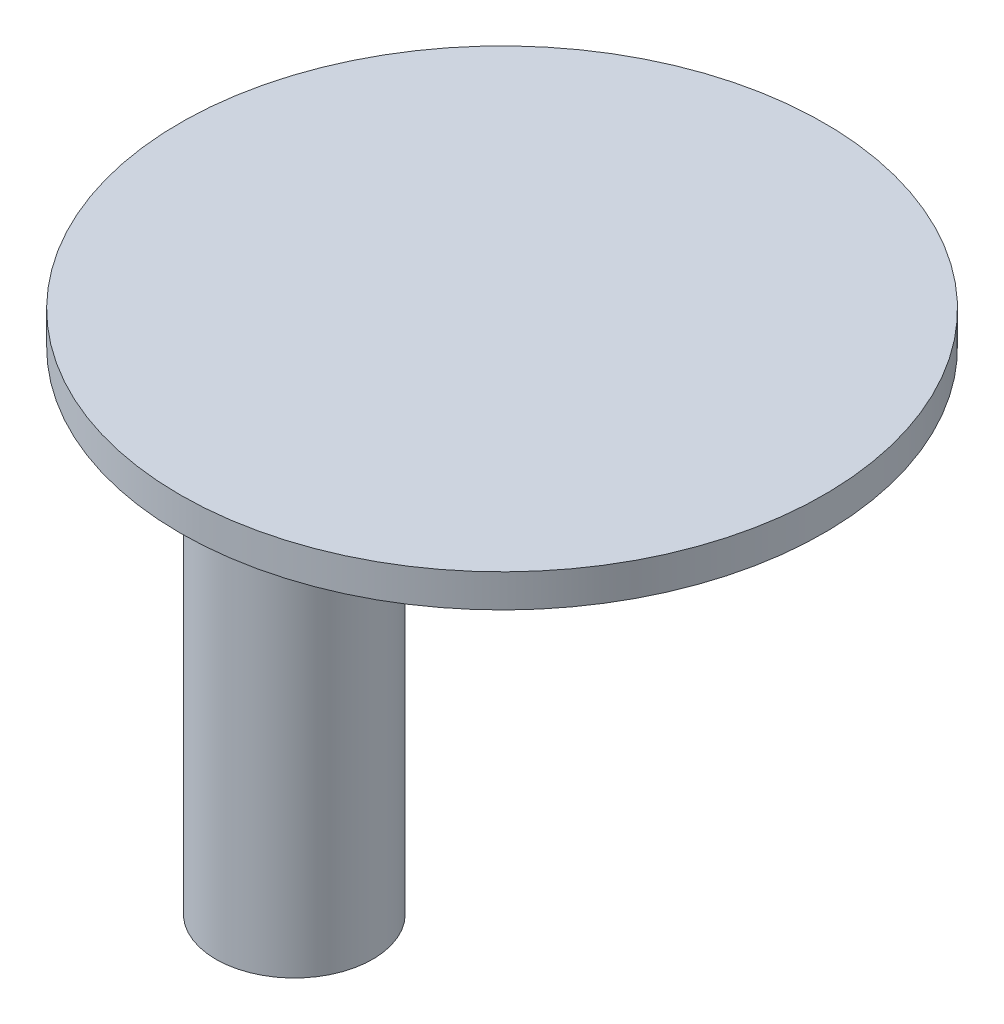
ISO-10303-21;
HEADER;
FILE_DESCRIPTION(('STEP AP214'),'2;1');
FILE_NAME('part.step','',(''),(''),'','','');
FILE_SCHEMA(('AUTOMOTIVE_DESIGN { 1 0 10303 214 1 1 1 1 }'));
ENDSEC;
DATA;
#1=APPLICATION_CONTEXT('core data for automotive mechanical design processes');
#2=APPLICATION_PROTOCOL_DEFINITION('international standard','automotive_design',2000,#1);
#3=PRODUCT_CONTEXT('',#1,'mechanical');
#4=PRODUCT('Part','Part','',(#3));
#5=PRODUCT_RELATED_PRODUCT_CATEGORY('part','',(#4));
#6=PRODUCT_DEFINITION_FORMATION('','',#4);
#7=PRODUCT_DEFINITION_CONTEXT('part definition',#1,'design');
#8=PRODUCT_DEFINITION('design','',#6,#7);
#9=PRODUCT_DEFINITION_SHAPE('','',#8);
#10=(LENGTH_UNIT() NAMED_UNIT(*) SI_UNIT(.MILLI.,.METRE.));
#11=(NAMED_UNIT(*) PLANE_ANGLE_UNIT() SI_UNIT($,.RADIAN.));
#12=(NAMED_UNIT(*) SI_UNIT($,.STERADIAN.) SOLID_ANGLE_UNIT());
#13=UNCERTAINTY_MEASURE_WITH_UNIT(LENGTH_MEASURE(1.E-05),#10,'distance_accuracy_value','');
#14=(GEOMETRIC_REPRESENTATION_CONTEXT(3) GLOBAL_UNCERTAINTY_ASSIGNED_CONTEXT((#13)) GLOBAL_UNIT_ASSIGNED_CONTEXT((#10,
#11,#12)) REPRESENTATION_CONTEXT('',''));
#15=CARTESIAN_POINT('',(0.,0.,0.));
#16=DIRECTION('',(0.,0.,1.));
#17=DIRECTION('',(1.,0.,0.));
#18=AXIS2_PLACEMENT_3D('',#15,#16,#17);
#19=CARTESIAN_POINT('',(0.,32.,0.));
#20=DIRECTION('',(0.,-1.,0.));
#21=DIRECTION('',(0.,0.,-1.));
#22=AXIS2_PLACEMENT_3D('',#19,#20,#21);
#23=CYLINDRICAL_SURFACE('',#22,4.75);
#24=CARTESIAN_POINT('',(0.,32.,0.));
#25=DIRECTION('',(0.,1.,0.));
#26=DIRECTION('',(0.,0.,1.));
#27=AXIS2_PLACEMENT_3D('',#24,#25,#26);
#28=CIRCLE('',#27,4.75);
#29=CARTESIAN_POINT('',(0.,32.,4.75));
#30=VERTEX_POINT('',#29);
#31=EDGE_CURVE('E10',#30,#30,#28,.T.);
#32=ORIENTED_EDGE('',*,*,#31,.F.);
#33=EDGE_LOOP('',(#32));
#34=FACE_BOUND('',#33,.T.);
#35=CARTESIAN_POINT('',(0.,0.,0.));
#36=DIRECTION('',(0.,1.,0.));
#37=DIRECTION('',(0.,0.,1.));
#38=AXIS2_PLACEMENT_3D('',#35,#36,#37);
#39=CIRCLE('',#38,4.75);
#40=CARTESIAN_POINT('',(0.,0.,4.75));
#41=VERTEX_POINT('',#40);
#42=EDGE_CURVE('E40',#41,#41,#39,.T.);
#43=ORIENTED_EDGE('',*,*,#42,.T.);
#44=EDGE_LOOP('',(#43));
#45=FACE_BOUND('',#44,.T.);
#46=ADVANCED_FACE('F37',(#34,#45),#23,.T.);
#47=CARTESIAN_POINT('',(0.,0.,0.));
#48=DIRECTION('',(0.,1.,0.));
#49=DIRECTION('',(0.,0.,1.));
#50=AXIS2_PLACEMENT_3D('',#47,#48,#49);
#51=PLANE('',#50);
#52=CARTESIAN_POINT('',(0.,0.,0.));
#53=DIRECTION('',(0.,-1.,0.));
#54=DIRECTION('',(0.,0.,-1.));
#55=AXIS2_PLACEMENT_3D('',#52,#53,#54);
#56=CIRCLE('',#55,1.8);
#57=CARTESIAN_POINT('',(0.,0.,-1.8));
#58=VERTEX_POINT('',#57);
#59=EDGE_CURVE('E49',#58,#58,#56,.T.);
#60=ORIENTED_EDGE('',*,*,#59,.F.);
#61=EDGE_LOOP('',(#60));
#62=FACE_BOUND('',#61,.T.);
#63=ORIENTED_EDGE('',*,*,#42,.F.);
#64=EDGE_LOOP('',(#63));
#65=FACE_BOUND('',#64,.T.);
#66=ADVANCED_FACE('F78',(#62,#65),#51,.F.);
#67=CARTESIAN_POINT('',(0.,3.,0.));
#68=DIRECTION('',(0.,-1.,0.));
#69=DIRECTION('',(0.,0.,-1.));
#70=AXIS2_PLACEMENT_3D('',#67,#68,#69);
#71=CYLINDRICAL_SURFACE('',#70,1.8);
#72=CARTESIAN_POINT('',(0.,3.,0.));
#73=DIRECTION('',(0.,-1.,0.));
#74=DIRECTION('',(0.,0.,-1.));
#75=AXIS2_PLACEMENT_3D('',#72,#73,#74);
#76=CIRCLE('',#75,1.8);
#77=CARTESIAN_POINT('',(0.,3.,-1.8));
#78=VERTEX_POINT('',#77);
#79=EDGE_CURVE('E47',#78,#78,#76,.T.);
#80=ORIENTED_EDGE('',*,*,#79,.F.);
#81=EDGE_LOOP('',(#80));
#82=FACE_BOUND('',#81,.T.);
#83=ORIENTED_EDGE('',*,*,#59,.T.);
#84=EDGE_LOOP('',(#83));
#85=FACE_BOUND('',#84,.T.);
#86=ADVANCED_FACE('F83',(#82,#85),#71,.F.);
#87=CARTESIAN_POINT('',(0.,3.,0.));
#88=DIRECTION('',(0.,-1.,0.));
#89=DIRECTION('',(0.,0.,-1.));
#90=AXIS2_PLACEMENT_3D('',#87,#88,#89);
#91=PLANE('',#90);
#92=ORIENTED_EDGE('',*,*,#79,.T.);
#93=EDGE_LOOP('',(#92));
#94=FACE_BOUND('',#93,.T.);
#95=ADVANCED_FACE('F66',(#94),#91,.T.);
#96=CARTESIAN_POINT('',(8.56,34.,-4.02));
#97=DIRECTION('',(0.,-1.,0.));
#98=DIRECTION('',(0.,0.,-1.));
#99=AXIS2_PLACEMENT_3D('',#96,#97,#98);
#100=CYLINDRICAL_SURFACE('',#99,19.5);
#101=CARTESIAN_POINT('',(8.56,34.,-4.02));
#102=DIRECTION('',(0.,1.,0.));
#103=DIRECTION('',(0.,0.,1.));
#104=AXIS2_PLACEMENT_3D('',#101,#102,#103);
#105=CIRCLE('',#104,19.5);
#106=CARTESIAN_POINT('',(8.56,34.,15.48));
#107=VERTEX_POINT('',#106);
#108=EDGE_CURVE('E52',#107,#107,#105,.T.);
#109=ORIENTED_EDGE('',*,*,#108,.F.);
#110=EDGE_LOOP('',(#109));
#111=FACE_BOUND('',#110,.T.);
#112=CARTESIAN_POINT('',(8.56,32.,-4.02));
#113=DIRECTION('',(0.,1.,0.));
#114=DIRECTION('',(0.,0.,1.));
#115=AXIS2_PLACEMENT_3D('',#112,#113,#114);
#116=CIRCLE('',#115,19.5);
#117=CARTESIAN_POINT('',(8.56,32.,15.48));
#118=VERTEX_POINT('',#117);
#119=EDGE_CURVE('E55',#118,#118,#116,.T.);
#120=ORIENTED_EDGE('',*,*,#119,.T.);
#121=EDGE_LOOP('',(#120));
#122=FACE_BOUND('',#121,.T.);
#123=ADVANCED_FACE('F63',(#111,#122),#100,.T.);
#124=CARTESIAN_POINT('',(8.56,34.,-4.02));
#125=DIRECTION('',(0.,1.,0.));
#126=DIRECTION('',(0.,0.,1.));
#127=AXIS2_PLACEMENT_3D('',#124,#125,#126);
#128=PLANE('',#127);
#129=ORIENTED_EDGE('',*,*,#108,.T.);
#130=EDGE_LOOP('',(#129));
#131=FACE_BOUND('',#130,.T.);
#132=ADVANCED_FACE('F61',(#131),#128,.T.);
#133=CARTESIAN_POINT('',(8.56,32.,-4.02));
#134=DIRECTION('',(0.,1.,0.));
#135=DIRECTION('',(0.,0.,1.));
#136=AXIS2_PLACEMENT_3D('',#133,#134,#135);
#137=PLANE('',#136);
#138=ORIENTED_EDGE('',*,*,#31,.T.);
#139=EDGE_LOOP('',(#138));
#140=FACE_BOUND('',#139,.T.);
#141=ORIENTED_EDGE('',*,*,#119,.F.);
#142=EDGE_LOOP('',(#141));
#143=FACE_BOUND('',#142,.T.);
#144=ADVANCED_FACE('F70',(#140,#143),#137,.F.);
#145=CLOSED_SHELL('',(#46,#66,#86,#95,#123,#132,#144));
#146=MANIFOLD_SOLID_BREP('B2',#145);
#147=ADVANCED_BREP_SHAPE_REPRESENTATION('',(#18,#146),#14);
#148=SHAPE_DEFINITION_REPRESENTATION(#9,#147);
ENDSEC;
END-ISO-10303-21;
